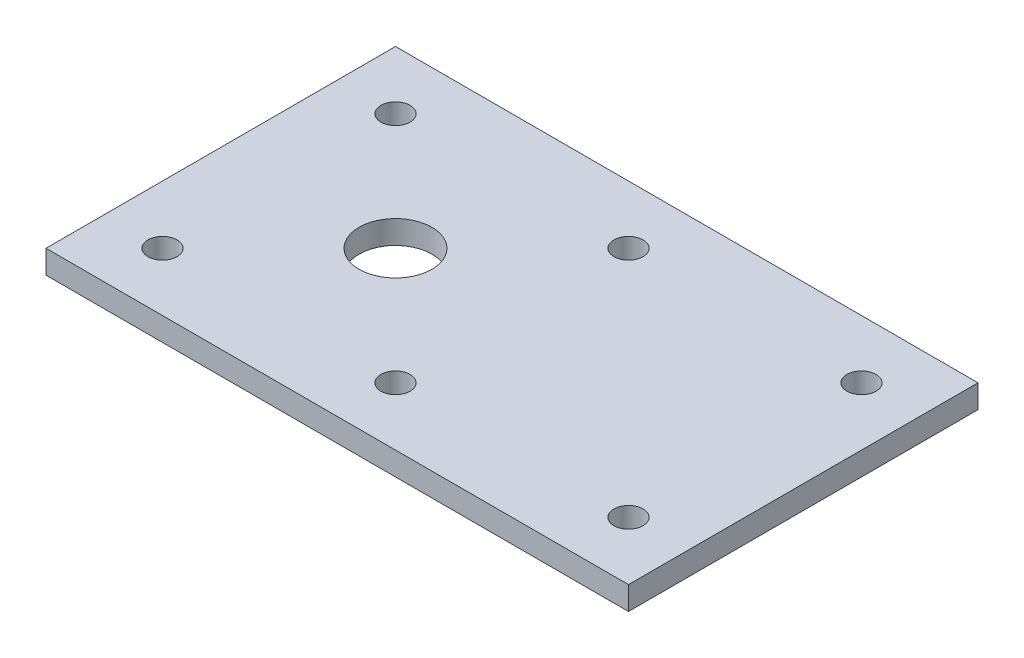
ISO-10303-21;
HEADER;
FILE_DESCRIPTION(('STEP AP214'),'2;1');
FILE_NAME('part.step','',(''),(''),'','','');
FILE_SCHEMA(('AUTOMOTIVE_DESIGN { 1 0 10303 214 1 1 1 1 }'));
ENDSEC;
DATA;
#1=APPLICATION_CONTEXT('core data for automotive mechanical design processes');
#2=APPLICATION_PROTOCOL_DEFINITION('international standard','automotive_design',2000,#1);
#3=PRODUCT_CONTEXT('',#1,'mechanical');
#4=PRODUCT('Part','Part','',(#3));
#5=PRODUCT_RELATED_PRODUCT_CATEGORY('part','',(#4));
#6=PRODUCT_DEFINITION_FORMATION('','',#4);
#7=PRODUCT_DEFINITION_CONTEXT('part definition',#1,'design');
#8=PRODUCT_DEFINITION('design','',#6,#7);
#9=PRODUCT_DEFINITION_SHAPE('','',#8);
#10=(LENGTH_UNIT() NAMED_UNIT(*) SI_UNIT(.MILLI.,.METRE.));
#11=(NAMED_UNIT(*) PLANE_ANGLE_UNIT() SI_UNIT($,.RADIAN.));
#12=(NAMED_UNIT(*) SI_UNIT($,.STERADIAN.) SOLID_ANGLE_UNIT());
#13=UNCERTAINTY_MEASURE_WITH_UNIT(LENGTH_MEASURE(1.E-05),#10,'distance_accuracy_value','');
#14=(GEOMETRIC_REPRESENTATION_CONTEXT(3) GLOBAL_UNCERTAINTY_ASSIGNED_CONTEXT((#13)) GLOBAL_UNIT_ASSIGNED_CONTEXT((#10,
#11,#12)) REPRESENTATION_CONTEXT('',''));
#15=CARTESIAN_POINT('',(0.,0.,0.));
#16=DIRECTION('',(0.,0.,1.));
#17=DIRECTION('',(1.,0.,0.));
#18=AXIS2_PLACEMENT_3D('',#15,#16,#17);
#19=CARTESIAN_POINT('',(120.,0.,40.));
#20=DIRECTION('',(0.,1.,0.));
#21=DIRECTION('',(0.,0.,1.));
#22=AXIS2_PLACEMENT_3D('',#19,#20,#21);
#23=CYLINDRICAL_SURFACE('',#22,5.);
#24=CARTESIAN_POINT('',(120.,0.,40.));
#25=DIRECTION('',(0.,1.,0.));
#26=DIRECTION('',(0.,0.,1.));
#27=AXIS2_PLACEMENT_3D('',#24,#25,#26);
#28=CIRCLE('',#27,5.);
#29=CARTESIAN_POINT('',(120.,0.,45.));
#30=VERTEX_POINT('',#29);
#31=EDGE_CURVE('E48',#30,#30,#28,.T.);
#32=ORIENTED_EDGE('',*,*,#31,.F.);
#33=EDGE_LOOP('',(#32));
#34=FACE_BOUND('',#33,.T.);
#35=CARTESIAN_POINT('',(120.,8.,40.));
#36=DIRECTION('',(0.,1.,0.));
#37=DIRECTION('',(0.,0.,1.));
#38=AXIS2_PLACEMENT_3D('',#35,#36,#37);
#39=CIRCLE('',#38,5.);
#40=CARTESIAN_POINT('',(120.,8.,45.));
#41=VERTEX_POINT('',#40);
#42=EDGE_CURVE('E11',#41,#41,#39,.T.);
#43=ORIENTED_EDGE('',*,*,#42,.T.);
#44=EDGE_LOOP('',(#43));
#45=FACE_BOUND('',#44,.T.);
#46=ADVANCED_FACE('F39',(#34,#45),#23,.F.);
#47=CARTESIAN_POINT('',(120.,0.,-40.));
#48=DIRECTION('',(0.,1.,0.));
#49=DIRECTION('',(0.,0.,1.));
#50=AXIS2_PLACEMENT_3D('',#47,#48,#49);
#51=CYLINDRICAL_SURFACE('',#50,5.);
#52=CARTESIAN_POINT('',(120.,0.,-40.));
#53=DIRECTION('',(0.,1.,0.));
#54=DIRECTION('',(0.,0.,1.));
#55=AXIS2_PLACEMENT_3D('',#52,#53,#54);
#56=CIRCLE('',#55,5.);
#57=CARTESIAN_POINT('',(120.,0.,-35.));
#58=VERTEX_POINT('',#57);
#59=EDGE_CURVE('E145',#58,#58,#56,.T.);
#60=ORIENTED_EDGE('',*,*,#59,.F.);
#61=EDGE_LOOP('',(#60));
#62=FACE_BOUND('',#61,.T.);
#63=CARTESIAN_POINT('',(120.,8.,-40.));
#64=DIRECTION('',(0.,1.,0.));
#65=DIRECTION('',(0.,0.,1.));
#66=AXIS2_PLACEMENT_3D('',#63,#64,#65);
#67=CIRCLE('',#66,5.);
#68=CARTESIAN_POINT('',(120.,8.,-35.));
#69=VERTEX_POINT('',#68);
#70=EDGE_CURVE('E149',#69,#69,#67,.T.);
#71=ORIENTED_EDGE('',*,*,#70,.T.);
#72=EDGE_LOOP('',(#71));
#73=FACE_BOUND('',#72,.T.);
#74=ADVANCED_FACE('F160',(#62,#73),#51,.F.);
#75=CARTESIAN_POINT('',(40.,0.,40.));
#76=DIRECTION('',(0.,1.,0.));
#77=DIRECTION('',(0.,0.,1.));
#78=AXIS2_PLACEMENT_3D('',#75,#76,#77);
#79=CYLINDRICAL_SURFACE('',#78,5.);
#80=CARTESIAN_POINT('',(40.,0.,40.));
#81=DIRECTION('',(0.,1.,0.));
#82=DIRECTION('',(0.,0.,1.));
#83=AXIS2_PLACEMENT_3D('',#80,#81,#82);
#84=CIRCLE('',#83,5.);
#85=CARTESIAN_POINT('',(40.,0.,45.));
#86=VERTEX_POINT('',#85);
#87=EDGE_CURVE('E137',#86,#86,#84,.T.);
#88=ORIENTED_EDGE('',*,*,#87,.F.);
#89=EDGE_LOOP('',(#88));
#90=FACE_BOUND('',#89,.T.);
#91=CARTESIAN_POINT('',(40.,8.,40.));
#92=DIRECTION('',(0.,1.,0.));
#93=DIRECTION('',(0.,0.,1.));
#94=AXIS2_PLACEMENT_3D('',#91,#92,#93);
#95=CIRCLE('',#94,5.);
#96=CARTESIAN_POINT('',(40.,8.,45.));
#97=VERTEX_POINT('',#96);
#98=EDGE_CURVE('E141',#97,#97,#95,.T.);
#99=ORIENTED_EDGE('',*,*,#98,.T.);
#100=EDGE_LOOP('',(#99));
#101=FACE_BOUND('',#100,.T.);
#102=ADVANCED_FACE('F191',(#90,#101),#79,.F.);
#103=CARTESIAN_POINT('',(40.,0.,-40.));
#104=DIRECTION('',(0.,1.,0.));
#105=DIRECTION('',(0.,0.,1.));
#106=AXIS2_PLACEMENT_3D('',#103,#104,#105);
#107=CYLINDRICAL_SURFACE('',#106,5.);
#108=CARTESIAN_POINT('',(40.,0.,-40.));
#109=DIRECTION('',(0.,1.,0.));
#110=DIRECTION('',(0.,0.,1.));
#111=AXIS2_PLACEMENT_3D('',#108,#109,#110);
#112=CIRCLE('',#111,5.);
#113=CARTESIAN_POINT('',(40.,0.,-35.));
#114=VERTEX_POINT('',#113);
#115=EDGE_CURVE('E129',#114,#114,#112,.T.);
#116=ORIENTED_EDGE('',*,*,#115,.F.);
#117=EDGE_LOOP('',(#116));
#118=FACE_BOUND('',#117,.T.);
#119=CARTESIAN_POINT('',(40.,8.,-40.));
#120=DIRECTION('',(0.,1.,0.));
#121=DIRECTION('',(0.,0.,1.));
#122=AXIS2_PLACEMENT_3D('',#119,#120,#121);
#123=CIRCLE('',#122,5.);
#124=CARTESIAN_POINT('',(40.,8.,-35.));
#125=VERTEX_POINT('',#124);
#126=EDGE_CURVE('E133',#125,#125,#123,.T.);
#127=ORIENTED_EDGE('',*,*,#126,.T.);
#128=EDGE_LOOP('',(#127));
#129=FACE_BOUND('',#128,.T.);
#130=ADVANCED_FACE('F187',(#118,#129),#107,.F.);
#131=CARTESIAN_POINT('',(-60.,8.,60.));
#132=DIRECTION('',(1.,0.,0.));
#133=DIRECTION('',(0.,0.,-1.));
#134=AXIS2_PLACEMENT_3D('',#131,#132,#133);
#135=PLANE('',#134);
#136=DIRECTION('',(0.,0.,1.));
#137=VECTOR('',#136,1.);
#138=CARTESIAN_POINT('',(-60.,0.,60.));
#139=LINE('',#138,#137);
#140=CARTESIAN_POINT('',(-60.,0.,-60.));
#141=VERTEX_POINT('',#140);
#142=CARTESIAN_POINT('',(-60.,0.,60.));
#143=VERTEX_POINT('',#142);
#144=EDGE_CURVE('E112',#141,#143,#139,.T.);
#145=ORIENTED_EDGE('',*,*,#144,.T.);
#146=DIRECTION('',(0.,-1.,0.));
#147=VECTOR('',#146,1.);
#148=CARTESIAN_POINT('',(-60.,8.,60.));
#149=LINE('',#148,#147);
#150=CARTESIAN_POINT('',(-60.,8.,60.));
#151=VERTEX_POINT('',#150);
#152=EDGE_CURVE('E101',#151,#143,#149,.T.);
#153=ORIENTED_EDGE('',*,*,#152,.F.);
#154=DIRECTION('',(0.,0.,1.));
#155=VECTOR('',#154,1.);
#156=CARTESIAN_POINT('',(-60.,8.,60.));
#157=LINE('',#156,#155);
#158=CARTESIAN_POINT('',(-60.,8.,-60.));
#159=VERTEX_POINT('',#158);
#160=EDGE_CURVE('E93',#159,#151,#157,.T.);
#161=ORIENTED_EDGE('',*,*,#160,.F.);
#162=DIRECTION('',(0.,-1.,0.));
#163=VECTOR('',#162,1.);
#164=CARTESIAN_POINT('',(-60.,8.,-60.));
#165=LINE('',#164,#163);
#166=EDGE_CURVE('E108',#159,#141,#165,.T.);
#167=ORIENTED_EDGE('',*,*,#166,.T.);
#168=EDGE_LOOP('',(#145,#153,#161,#167));
#169=FACE_BOUND('',#168,.T.);
#170=ADVANCED_FACE('F184',(#169),#135,.F.);
#171=CARTESIAN_POINT('',(-60.,8.,60.));
#172=DIRECTION('',(0.,0.,-1.));
#173=DIRECTION('',(-1.,0.,0.));
#174=AXIS2_PLACEMENT_3D('',#171,#172,#173);
#175=PLANE('',#174);
#176=DIRECTION('',(1.,0.,0.));
#177=VECTOR('',#176,1.);
#178=CARTESIAN_POINT('',(-60.,0.,60.));
#179=LINE('',#178,#177);
#180=CARTESIAN_POINT('',(140.,0.,60.));
#181=VERTEX_POINT('',#180);
#182=EDGE_CURVE('E99',#143,#181,#179,.T.);
#183=ORIENTED_EDGE('',*,*,#182,.T.);
#184=DIRECTION('',(0.,-1.,0.));
#185=VECTOR('',#184,1.);
#186=CARTESIAN_POINT('',(140.,8.,60.));
#187=LINE('',#186,#185);
#188=CARTESIAN_POINT('',(140.,8.,60.));
#189=VERTEX_POINT('',#188);
#190=EDGE_CURVE('E97',#189,#181,#187,.T.);
#191=ORIENTED_EDGE('',*,*,#190,.F.);
#192=DIRECTION('',(1.,0.,0.));
#193=VECTOR('',#192,1.);
#194=CARTESIAN_POINT('',(-60.,8.,60.));
#195=LINE('',#194,#193);
#196=EDGE_CURVE('E87',#151,#189,#195,.T.);
#197=ORIENTED_EDGE('',*,*,#196,.F.);
#198=ORIENTED_EDGE('',*,*,#152,.T.);
#199=EDGE_LOOP('',(#183,#191,#197,#198));
#200=FACE_BOUND('',#199,.T.);
#201=ADVANCED_FACE('F98',(#200),#175,.F.);
#202=CARTESIAN_POINT('',(140.,8.,60.));
#203=DIRECTION('',(-1.,0.,0.));
#204=DIRECTION('',(0.,0.,1.));
#205=AXIS2_PLACEMENT_3D('',#202,#203,#204);
#206=PLANE('',#205);
#207=DIRECTION('',(0.,0.,-1.));
#208=VECTOR('',#207,1.);
#209=CARTESIAN_POINT('',(140.,0.,60.));
#210=LINE('',#209,#208);
#211=CARTESIAN_POINT('',(140.,0.,-60.));
#212=VERTEX_POINT('',#211);
#213=EDGE_CURVE('E73',#181,#212,#210,.T.);
#214=ORIENTED_EDGE('',*,*,#213,.T.);
#215=DIRECTION('',(0.,-1.,0.));
#216=VECTOR('',#215,1.);
#217=CARTESIAN_POINT('',(140.,8.,-60.));
#218=LINE('',#217,#216);
#219=CARTESIAN_POINT('',(140.,8.,-60.));
#220=VERTEX_POINT('',#219);
#221=EDGE_CURVE('E102',#220,#212,#218,.T.);
#222=ORIENTED_EDGE('',*,*,#221,.F.);
#223=DIRECTION('',(0.,0.,-1.));
#224=VECTOR('',#223,1.);
#225=CARTESIAN_POINT('',(140.,8.,60.));
#226=LINE('',#225,#224);
#227=EDGE_CURVE('E91',#189,#220,#226,.T.);
#228=ORIENTED_EDGE('',*,*,#227,.F.);
#229=ORIENTED_EDGE('',*,*,#190,.T.);
#230=EDGE_LOOP('',(#214,#222,#228,#229));
#231=FACE_BOUND('',#230,.T.);
#232=ADVANCED_FACE('F104',(#231),#206,.F.);
#233=CARTESIAN_POINT('',(-60.,8.,-60.));
#234=DIRECTION('',(0.,0.,1.));
#235=DIRECTION('',(1.,0.,0.));
#236=AXIS2_PLACEMENT_3D('',#233,#234,#235);
#237=PLANE('',#236);
#238=DIRECTION('',(-1.,0.,0.));
#239=VECTOR('',#238,1.);
#240=CARTESIAN_POINT('',(-60.,0.,-60.));
#241=LINE('',#240,#239);
#242=EDGE_CURVE('E79',#212,#141,#241,.T.);
#243=ORIENTED_EDGE('',*,*,#242,.T.);
#244=ORIENTED_EDGE('',*,*,#166,.F.);
#245=DIRECTION('',(-1.,0.,0.));
#246=VECTOR('',#245,1.);
#247=CARTESIAN_POINT('',(-60.,8.,-60.));
#248=LINE('',#247,#246);
#249=EDGE_CURVE('E56',#220,#159,#248,.T.);
#250=ORIENTED_EDGE('',*,*,#249,.F.);
#251=ORIENTED_EDGE('',*,*,#221,.T.);
#252=EDGE_LOOP('',(#243,#244,#250,#251));
#253=FACE_BOUND('',#252,.T.);
#254=ADVANCED_FACE('F164',(#253),#237,.F.);
#255=CARTESIAN_POINT('',(0.,8.,0.));
#256=DIRECTION('',(0.,-1.,0.));
#257=DIRECTION('',(0.,0.,-1.));
#258=AXIS2_PLACEMENT_3D('',#255,#256,#257);
#259=PLANE('',#258);
#260=CARTESIAN_POINT('',(0.,8.,0.));
#261=DIRECTION('',(0.,1.,0.));
#262=DIRECTION('',(0.,0.,1.));
#263=AXIS2_PLACEMENT_3D('',#260,#261,#262);
#264=CIRCLE('',#263,12.5);
#265=CARTESIAN_POINT('',(0.,8.,12.5));
#266=VERTEX_POINT('',#265);
#267=EDGE_CURVE('E286',#266,#266,#264,.T.);
#268=ORIENTED_EDGE('',*,*,#267,.F.);
#269=EDGE_LOOP('',(#268));
#270=FACE_BOUND('',#269,.T.);
#271=CARTESIAN_POINT('',(-40.,8.,40.));
#272=DIRECTION('',(0.,1.,0.));
#273=DIRECTION('',(0.,0.,1.));
#274=AXIS2_PLACEMENT_3D('',#271,#272,#273);
#275=CIRCLE('',#274,5.);
#276=CARTESIAN_POINT('',(-40.,8.,45.));
#277=VERTEX_POINT('',#276);
#278=EDGE_CURVE('E296',#277,#277,#275,.T.);
#279=ORIENTED_EDGE('',*,*,#278,.F.);
#280=EDGE_LOOP('',(#279));
#281=FACE_BOUND('',#280,.T.);
#282=CARTESIAN_POINT('',(-40.,8.,-40.));
#283=DIRECTION('',(0.,1.,0.));
#284=DIRECTION('',(0.,0.,1.));
#285=AXIS2_PLACEMENT_3D('',#282,#283,#284);
#286=CIRCLE('',#285,5.);
#287=CARTESIAN_POINT('',(-40.,8.,-35.));
#288=VERTEX_POINT('',#287);
#289=EDGE_CURVE('E300',#288,#288,#286,.T.);
#290=ORIENTED_EDGE('',*,*,#289,.F.);
#291=EDGE_LOOP('',(#290));
#292=FACE_BOUND('',#291,.T.);
#293=ORIENTED_EDGE('',*,*,#160,.T.);
#294=ORIENTED_EDGE('',*,*,#196,.T.);
#295=ORIENTED_EDGE('',*,*,#227,.T.);
#296=ORIENTED_EDGE('',*,*,#249,.T.);
#297=EDGE_LOOP('',(#293,#294,#295,#296));
#298=FACE_BOUND('',#297,.T.);
#299=ORIENTED_EDGE('',*,*,#126,.F.);
#300=EDGE_LOOP('',(#299));
#301=FACE_BOUND('',#300,.T.);
#302=ORIENTED_EDGE('',*,*,#98,.F.);
#303=EDGE_LOOP('',(#302));
#304=FACE_BOUND('',#303,.T.);
#305=ORIENTED_EDGE('',*,*,#70,.F.);
#306=EDGE_LOOP('',(#305));
#307=FACE_BOUND('',#306,.T.);
#308=ORIENTED_EDGE('',*,*,#42,.F.);
#309=EDGE_LOOP('',(#308));
#310=FACE_BOUND('',#309,.T.);
#311=ADVANCED_FACE('F88',(#270,#281,#292,#298,#301,#304,#307,#310),#259,.F.);
#312=CARTESIAN_POINT('',(0.,0.,0.));
#313=DIRECTION('',(0.,-1.,0.));
#314=DIRECTION('',(0.,0.,-1.));
#315=AXIS2_PLACEMENT_3D('',#312,#313,#314);
#316=PLANE('',#315);
#317=CARTESIAN_POINT('',(0.,0.,0.));
#318=DIRECTION('',(0.,1.,0.));
#319=DIRECTION('',(0.,0.,1.));
#320=AXIS2_PLACEMENT_3D('',#317,#318,#319);
#321=CIRCLE('',#320,12.5);
#322=CARTESIAN_POINT('',(0.,0.,12.5));
#323=VERTEX_POINT('',#322);
#324=EDGE_CURVE('E284',#323,#323,#321,.T.);
#325=ORIENTED_EDGE('',*,*,#324,.T.);
#326=EDGE_LOOP('',(#325));
#327=FACE_BOUND('',#326,.T.);
#328=CARTESIAN_POINT('',(-40.,0.,40.));
#329=DIRECTION('',(0.,1.,0.));
#330=DIRECTION('',(0.,0.,1.));
#331=AXIS2_PLACEMENT_3D('',#328,#329,#330);
#332=CIRCLE('',#331,5.);
#333=CARTESIAN_POINT('',(-40.,0.,45.));
#334=VERTEX_POINT('',#333);
#335=EDGE_CURVE('E290',#334,#334,#332,.T.);
#336=ORIENTED_EDGE('',*,*,#335,.T.);
#337=EDGE_LOOP('',(#336));
#338=FACE_BOUND('',#337,.T.);
#339=CARTESIAN_POINT('',(-40.,0.,-40.));
#340=DIRECTION('',(0.,1.,0.));
#341=DIRECTION('',(0.,0.,1.));
#342=AXIS2_PLACEMENT_3D('',#339,#340,#341);
#343=CIRCLE('',#342,5.);
#344=CARTESIAN_POINT('',(-40.,0.,-35.));
#345=VERTEX_POINT('',#344);
#346=EDGE_CURVE('E116',#345,#345,#343,.T.);
#347=ORIENTED_EDGE('',*,*,#346,.T.);
#348=EDGE_LOOP('',(#347));
#349=FACE_BOUND('',#348,.T.);
#350=ORIENTED_EDGE('',*,*,#144,.F.);
#351=ORIENTED_EDGE('',*,*,#242,.F.);
#352=ORIENTED_EDGE('',*,*,#213,.F.);
#353=ORIENTED_EDGE('',*,*,#182,.F.);
#354=EDGE_LOOP('',(#350,#351,#352,#353));
#355=FACE_BOUND('',#354,.T.);
#356=ORIENTED_EDGE('',*,*,#115,.T.);
#357=EDGE_LOOP('',(#356));
#358=FACE_BOUND('',#357,.T.);
#359=ORIENTED_EDGE('',*,*,#87,.T.);
#360=EDGE_LOOP('',(#359));
#361=FACE_BOUND('',#360,.T.);
#362=ORIENTED_EDGE('',*,*,#59,.T.);
#363=EDGE_LOOP('',(#362));
#364=FACE_BOUND('',#363,.T.);
#365=ORIENTED_EDGE('',*,*,#31,.T.);
#366=EDGE_LOOP('',(#365));
#367=FACE_BOUND('',#366,.T.);
#368=ADVANCED_FACE('F156',(#327,#338,#349,#355,#358,#361,#364,#367),#316,.T.);
#369=CARTESIAN_POINT('',(-40.,0.,-40.));
#370=DIRECTION('',(0.,1.,0.));
#371=DIRECTION('',(0.,0.,1.));
#372=AXIS2_PLACEMENT_3D('',#369,#370,#371);
#373=CYLINDRICAL_SURFACE('',#372,5.);
#374=ORIENTED_EDGE('',*,*,#346,.F.);
#375=EDGE_LOOP('',(#374));
#376=FACE_BOUND('',#375,.T.);
#377=ORIENTED_EDGE('',*,*,#289,.T.);
#378=EDGE_LOOP('',(#377));
#379=FACE_BOUND('',#378,.T.);
#380=ADVANCED_FACE('F171',(#376,#379),#373,.F.);
#381=CARTESIAN_POINT('',(-40.,0.,40.));
#382=DIRECTION('',(0.,1.,0.));
#383=DIRECTION('',(0.,0.,1.));
#384=AXIS2_PLACEMENT_3D('',#381,#382,#383);
#385=CYLINDRICAL_SURFACE('',#384,5.);
#386=ORIENTED_EDGE('',*,*,#335,.F.);
#387=EDGE_LOOP('',(#386));
#388=FACE_BOUND('',#387,.T.);
#389=ORIENTED_EDGE('',*,*,#278,.T.);
#390=EDGE_LOOP('',(#389));
#391=FACE_BOUND('',#390,.T.);
#392=ADVANCED_FACE('F240',(#388,#391),#385,.F.);
#393=CARTESIAN_POINT('',(0.,0.,0.));
#394=DIRECTION('',(0.,1.,0.));
#395=DIRECTION('',(0.,0.,1.));
#396=AXIS2_PLACEMENT_3D('',#393,#394,#395);
#397=CYLINDRICAL_SURFACE('',#396,12.5);
#398=ORIENTED_EDGE('',*,*,#324,.F.);
#399=EDGE_LOOP('',(#398));
#400=FACE_BOUND('',#399,.T.);
#401=ORIENTED_EDGE('',*,*,#267,.T.);
#402=EDGE_LOOP('',(#401));
#403=FACE_BOUND('',#402,.T.);
#404=ADVANCED_FACE('F261',(#400,#403),#397,.F.);
#405=CLOSED_SHELL('',(#46,#74,#102,#130,#170,#201,#232,#254,#311,#368,#380,#392,#404));
#406=MANIFOLD_SOLID_BREP('B2',#405);
#407=ADVANCED_BREP_SHAPE_REPRESENTATION('',(#18,#406),#14);
#408=SHAPE_DEFINITION_REPRESENTATION(#9,#407);
ENDSEC;
END-ISO-10303-21;
